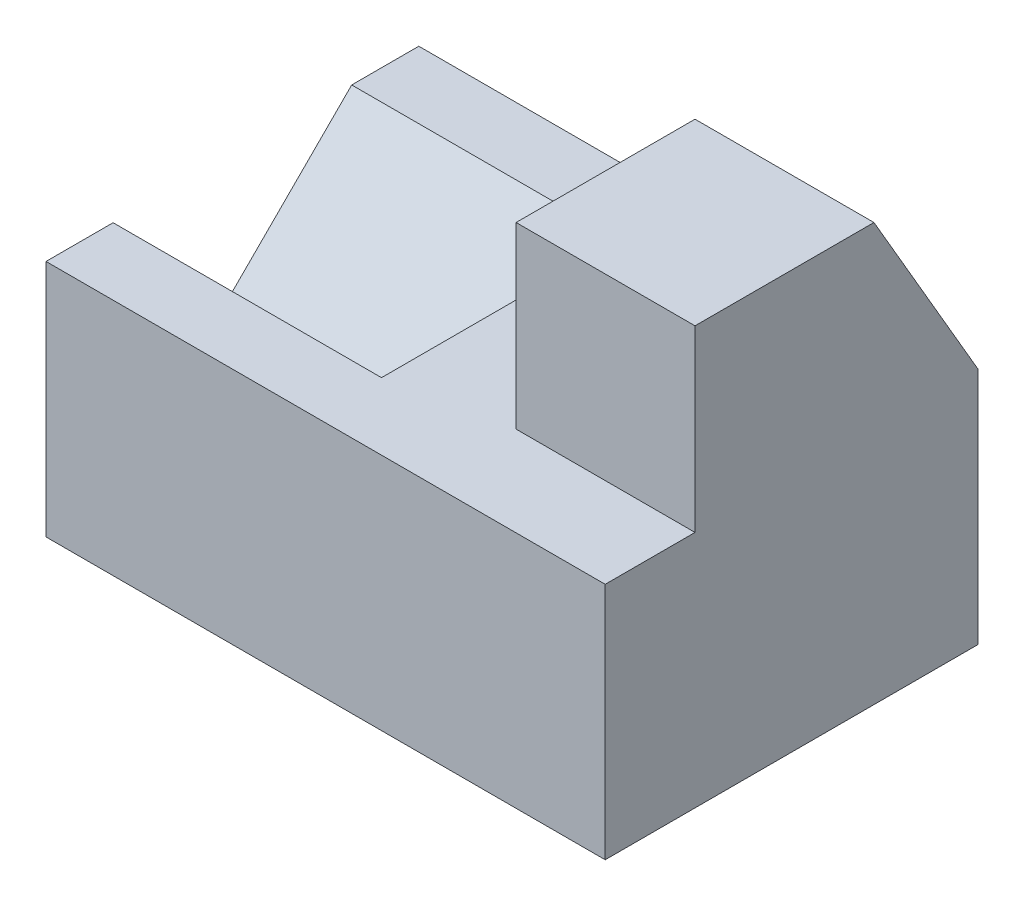
ISO-10303-21;
HEADER;
FILE_DESCRIPTION(('STEP AP214'),'2;1');
FILE_NAME('part.step','',(''),(''),'','','');
FILE_SCHEMA(('AUTOMOTIVE_DESIGN { 1 0 10303 214 1 1 1 1 }'));
ENDSEC;
DATA;
#1=APPLICATION_CONTEXT('core data for automotive mechanical design processes');
#2=APPLICATION_PROTOCOL_DEFINITION('international standard','automotive_design',2000,#1);
#3=PRODUCT_CONTEXT('',#1,'mechanical');
#4=PRODUCT('Part','Part','',(#3));
#5=PRODUCT_RELATED_PRODUCT_CATEGORY('part','',(#4));
#6=PRODUCT_DEFINITION_FORMATION('','',#4);
#7=PRODUCT_DEFINITION_CONTEXT('part definition',#1,'design');
#8=PRODUCT_DEFINITION('design','',#6,#7);
#9=PRODUCT_DEFINITION_SHAPE('','',#8);
#10=(LENGTH_UNIT() NAMED_UNIT(*) SI_UNIT(.MILLI.,.METRE.));
#11=(NAMED_UNIT(*) PLANE_ANGLE_UNIT() SI_UNIT($,.RADIAN.));
#12=(NAMED_UNIT(*) SI_UNIT($,.STERADIAN.) SOLID_ANGLE_UNIT());
#13=UNCERTAINTY_MEASURE_WITH_UNIT(LENGTH_MEASURE(1.E-05),#10,'distance_accuracy_value','');
#14=(GEOMETRIC_REPRESENTATION_CONTEXT(3) GLOBAL_UNCERTAINTY_ASSIGNED_CONTEXT((#13)) GLOBAL_UNIT_ASSIGNED_CONTEXT((#10,
#11,#12)) REPRESENTATION_CONTEXT('',''));
#15=CARTESIAN_POINT('',(0.,0.,0.));
#16=DIRECTION('',(0.,0.,1.));
#17=DIRECTION('',(1.,0.,0.));
#18=AXIS2_PLACEMENT_3D('',#15,#16,#17);
#19=CARTESIAN_POINT('',(-75.,0.,9.86934383281291));
#20=DIRECTION('',(0.,0.,-1.));
#21=DIRECTION('',(-1.,0.,0.));
#22=AXIS2_PLACEMENT_3D('',#19,#20,#21);
#23=PLANE('',#22);
#24=DIRECTION('',(0.,1.,0.));
#25=VECTOR('',#24,1.);
#26=CARTESIAN_POINT('',(-24.,13.8559556786704,9.86934383281291));
#27=LINE('',#26,#25);
#28=CARTESIAN_POINT('',(-24.,13.8559556786704,9.86934383281291));
#29=VERTEX_POINT('',#28);
#30=CARTESIAN_POINT('',(-24.,37.8559556786704,9.86934383281291));
#31=VERTEX_POINT('',#30);
#32=EDGE_CURVE('E179',#29,#31,#27,.T.);
#33=ORIENTED_EDGE('',*,*,#32,.F.);
#34=DIRECTION('',(1.,0.,0.));
#35=VECTOR('',#34,1.);
#36=CARTESIAN_POINT('',(-75.,13.8559556786704,9.86934383281291));
#37=LINE('',#36,#35);
#38=CARTESIAN_POINT('',(0.,13.8559556786704,9.86934383281291));
#39=VERTEX_POINT('',#38);
#40=EDGE_CURVE('E11',#29,#39,#37,.T.);
#41=ORIENTED_EDGE('',*,*,#40,.T.);
#42=DIRECTION('',(0.,1.,0.));
#43=VECTOR('',#42,1.);
#44=CARTESIAN_POINT('',(0.,0.,9.86934383281291));
#45=LINE('',#44,#43);
#46=CARTESIAN_POINT('',(0.,37.8559556786704,9.86934383281291));
#47=VERTEX_POINT('',#46);
#48=EDGE_CURVE('E221',#39,#47,#45,.T.);
#49=ORIENTED_EDGE('',*,*,#48,.T.);
#50=DIRECTION('',(1.,0.,0.));
#51=VECTOR('',#50,1.);
#52=CARTESIAN_POINT('',(-75.,37.8559556786704,9.86934383281291));
#53=LINE('',#52,#51);
#54=EDGE_CURVE('E55',#31,#47,#53,.T.);
#55=ORIENTED_EDGE('',*,*,#54,.F.);
#56=EDGE_LOOP('',(#33,#41,#49,#55));
#57=FACE_BOUND('',#56,.T.);
#58=ADVANCED_FACE('F45',(#57),#23,.F.);
#59=CARTESIAN_POINT('',(-75.,37.8559556786704,0.));
#60=DIRECTION('',(0.,-1.,0.));
#61=DIRECTION('',(0.,0.,-1.));
#62=AXIS2_PLACEMENT_3D('',#59,#60,#61);
#63=PLANE('',#62);
#64=DIRECTION('',(0.,0.,-1.));
#65=VECTOR('',#64,1.);
#66=CARTESIAN_POINT('',(-24.,37.8559556786704,9.86934383281291));
#67=LINE('',#66,#65);
#68=CARTESIAN_POINT('',(-24.,37.8559556786704,-14.1306561671871));
#69=VERTEX_POINT('',#68);
#70=EDGE_CURVE('E182',#31,#69,#67,.T.);
#71=ORIENTED_EDGE('',*,*,#70,.F.);
#72=ORIENTED_EDGE('',*,*,#54,.T.);
#73=DIRECTION('',(0.,0.,-1.));
#74=VECTOR('',#73,1.);
#75=CARTESIAN_POINT('',(0.,37.8559556786704,0.));
#76=LINE('',#75,#74);
#77=CARTESIAN_POINT('',(0.,37.8559556786704,-14.1306561671871));
#78=VERTEX_POINT('',#77);
#79=EDGE_CURVE('E217',#47,#78,#76,.T.);
#80=ORIENTED_EDGE('',*,*,#79,.T.);
#81=DIRECTION('',(1.,0.,0.));
#82=VECTOR('',#81,1.);
#83=CARTESIAN_POINT('',(-75.,37.8559556786704,-14.1306561671871));
#84=LINE('',#83,#82);
#85=EDGE_CURVE('E226',#69,#78,#84,.T.);
#86=ORIENTED_EDGE('',*,*,#85,.F.);
#87=EDGE_LOOP('',(#71,#72,#80,#86));
#88=FACE_BOUND('',#87,.T.);
#89=ADVANCED_FACE('F253',(#88),#63,.F.);
#90=CARTESIAN_POINT('',(-75.,15.7023340079224,-27.0098117291545));
#91=DIRECTION('',(0.,-0.502595461302605,0.864521718800645));
#92=DIRECTION('',(0.,-0.864521718800645,-0.502595461302605));
#93=AXIS2_PLACEMENT_3D('',#90,#91,#92);
#94=PLANE('',#93);
#95=DIRECTION('',(0.,-0.864521718800645,-0.502595461302605));
#96=VECTOR('',#95,1.);
#97=CARTESIAN_POINT('',(-24.,37.8559556786704,-14.1306561671871));
#98=LINE('',#97,#96);
#99=CARTESIAN_POINT('',(-24.,13.8559556786704,-28.083216072792));
#100=VERTEX_POINT('',#99);
#101=EDGE_CURVE('E170',#69,#100,#98,.T.);
#102=ORIENTED_EDGE('',*,*,#101,.F.);
#103=ORIENTED_EDGE('',*,*,#85,.T.);
#104=DIRECTION('',(0.,-0.864521718800645,-0.502595461302605));
#105=VECTOR('',#104,1.);
#106=CARTESIAN_POINT('',(0.,15.7023340079224,-27.0098117291545));
#107=LINE('',#106,#105);
#108=CARTESIAN_POINT('',(0.,13.8559556786704,-28.083216072792));
#109=VERTEX_POINT('',#108);
#110=EDGE_CURVE('E213',#78,#109,#107,.T.);
#111=ORIENTED_EDGE('',*,*,#110,.T.);
#112=DIRECTION('',(1.,0.,0.));
#113=VECTOR('',#112,1.);
#114=CARTESIAN_POINT('',(-75.,13.8559556786704,-28.083216072792));
#115=LINE('',#114,#113);
#116=EDGE_CURVE('E233',#100,#109,#115,.T.);
#117=ORIENTED_EDGE('',*,*,#116,.F.);
#118=EDGE_LOOP('',(#102,#103,#111,#117));
#119=FACE_BOUND('',#118,.T.);
#120=ADVANCED_FACE('F260',(#119),#94,.F.);
#121=CARTESIAN_POINT('',(-75.,13.8559556786704,0.));
#122=DIRECTION('',(0.,-1.,0.));
#123=DIRECTION('',(0.,0.,-1.));
#124=AXIS2_PLACEMENT_3D('',#121,#122,#123);
#125=PLANE('',#124);
#126=DIRECTION('',(0.,0.,-1.));
#127=VECTOR('',#126,1.);
#128=CARTESIAN_POINT('',(-75.,13.8559556786704,0.));
#129=LINE('',#128,#127);
#130=CARTESIAN_POINT('',(-75.,13.8559556786704,-19.083216072792));
#131=VERTEX_POINT('',#130);
#132=CARTESIAN_POINT('',(-75.,13.8559556786704,-28.083216072792));
#133=VERTEX_POINT('',#132);
#134=EDGE_CURVE('E71',#131,#133,#129,.T.);
#135=ORIENTED_EDGE('',*,*,#134,.F.);
#136=DIRECTION('',(-1.,0.,0.));
#137=VECTOR('',#136,1.);
#138=CARTESIAN_POINT('',(-39.,13.8559556786704,-19.083216072792));
#139=LINE('',#138,#137);
#140=CARTESIAN_POINT('',(-39.,13.8559556786704,-19.083216072792));
#141=VERTEX_POINT('',#140);
#142=EDGE_CURVE('E167',#141,#131,#139,.T.);
#143=ORIENTED_EDGE('',*,*,#142,.F.);
#144=DIRECTION('',(0.,0.,-1.));
#145=VECTOR('',#144,1.);
#146=CARTESIAN_POINT('',(-39.,13.8559556786704,-19.083216072792));
#147=LINE('',#146,#145);
#148=CARTESIAN_POINT('',(-39.,13.8559556786704,12.916783927208));
#149=VERTEX_POINT('',#148);
#150=EDGE_CURVE('E145',#149,#141,#147,.T.);
#151=ORIENTED_EDGE('',*,*,#150,.F.);
#152=DIRECTION('',(-1.,0.,0.));
#153=VECTOR('',#152,1.);
#154=CARTESIAN_POINT('',(-39.,13.8559556786704,12.916783927208));
#155=LINE('',#154,#153);
#156=CARTESIAN_POINT('',(-75.,13.8559556786704,12.916783927208));
#157=VERTEX_POINT('',#156);
#158=EDGE_CURVE('E144',#149,#157,#155,.T.);
#159=ORIENTED_EDGE('',*,*,#158,.T.);
#160=CARTESIAN_POINT('',(-75.,13.8559556786704,21.916783927208));
#161=VERTEX_POINT('',#160);
#162=EDGE_CURVE('E186',#161,#157,#129,.T.);
#163=ORIENTED_EDGE('',*,*,#162,.F.);
#164=DIRECTION('',(1.,0.,0.));
#165=VECTOR('',#164,1.);
#166=CARTESIAN_POINT('',(-75.,13.8559556786704,21.916783927208));
#167=LINE('',#166,#165);
#168=CARTESIAN_POINT('',(0.,13.8559556786704,21.916783927208));
#169=VERTEX_POINT('',#168);
#170=EDGE_CURVE('E49',#161,#169,#167,.T.);
#171=ORIENTED_EDGE('',*,*,#170,.T.);
#172=DIRECTION('',(0.,0.,-1.));
#173=VECTOR('',#172,1.);
#174=CARTESIAN_POINT('',(0.,13.8559556786704,0.));
#175=LINE('',#174,#173);
#176=EDGE_CURVE('E185',#169,#39,#175,.T.);
#177=ORIENTED_EDGE('',*,*,#176,.T.);
#178=ORIENTED_EDGE('',*,*,#40,.F.);
#179=DIRECTION('',(0.,0.,1.));
#180=VECTOR('',#179,1.);
#181=CARTESIAN_POINT('',(-24.,13.8559556786704,-28.083216072792));
#182=LINE('',#181,#180);
#183=EDGE_CURVE('E176',#100,#29,#182,.T.);
#184=ORIENTED_EDGE('',*,*,#183,.F.);
#185=EDGE_CURVE('E229',#133,#100,#115,.T.);
#186=ORIENTED_EDGE('',*,*,#185,.F.);
#187=EDGE_LOOP('',(#135,#143,#151,#159,#163,#171,#177,#178,#184,#186));
#188=FACE_BOUND('',#187,.T.);
#189=ADVANCED_FACE('F47',(#188),#125,.F.);
#190=CARTESIAN_POINT('',(-75.,0.,-28.083216072792));
#191=DIRECTION('',(0.,0.,-1.));
#192=DIRECTION('',(-1.,0.,0.));
#193=AXIS2_PLACEMENT_3D('',#190,#191,#192);
#194=PLANE('',#193);
#195=DIRECTION('',(0.,1.,0.));
#196=VECTOR('',#195,1.);
#197=CARTESIAN_POINT('',(0.,0.,-28.083216072792));
#198=LINE('',#197,#196);
#199=CARTESIAN_POINT('',(0.,-18.1440443213296,-28.083216072792));
#200=VERTEX_POINT('',#199);
#201=EDGE_CURVE('E209',#200,#109,#198,.T.);
#202=ORIENTED_EDGE('',*,*,#201,.F.);
#203=DIRECTION('',(1.,0.,0.));
#204=VECTOR('',#203,1.);
#205=CARTESIAN_POINT('',(-75.,-18.1440443213296,-28.083216072792));
#206=LINE('',#205,#204);
#207=CARTESIAN_POINT('',(-75.,-18.1440443213296,-28.083216072792));
#208=VERTEX_POINT('',#207);
#209=EDGE_CURVE('E234',#208,#200,#206,.T.);
#210=ORIENTED_EDGE('',*,*,#209,.F.);
#211=DIRECTION('',(0.,1.,0.));
#212=VECTOR('',#211,1.);
#213=CARTESIAN_POINT('',(-75.,0.,-28.083216072792));
#214=LINE('',#213,#212);
#215=EDGE_CURVE('E195',#208,#133,#214,.T.);
#216=ORIENTED_EDGE('',*,*,#215,.T.);
#217=ORIENTED_EDGE('',*,*,#185,.T.);
#218=ORIENTED_EDGE('',*,*,#116,.T.);
#219=EDGE_LOOP('',(#202,#210,#216,#217,#218));
#220=FACE_BOUND('',#219,.T.);
#221=ADVANCED_FACE('F264',(#220),#194,.T.);
#222=CARTESIAN_POINT('',(-75.,-18.1440443213296,0.));
#223=DIRECTION('',(0.,-1.,0.));
#224=DIRECTION('',(0.,0.,-1.));
#225=AXIS2_PLACEMENT_3D('',#222,#223,#224);
#226=PLANE('',#225);
#227=DIRECTION('',(0.,0.,-1.));
#228=VECTOR('',#227,1.);
#229=CARTESIAN_POINT('',(0.,-18.1440443213296,0.));
#230=LINE('',#229,#228);
#231=CARTESIAN_POINT('',(0.,-18.1440443213296,21.916783927208));
#232=VERTEX_POINT('',#231);
#233=EDGE_CURVE('E205',#232,#200,#230,.T.);
#234=ORIENTED_EDGE('',*,*,#233,.F.);
#235=DIRECTION('',(1.,0.,0.));
#236=VECTOR('',#235,1.);
#237=CARTESIAN_POINT('',(-75.,-18.1440443213296,21.916783927208));
#238=LINE('',#237,#236);
#239=CARTESIAN_POINT('',(-75.,-18.1440443213296,21.916783927208));
#240=VERTEX_POINT('',#239);
#241=EDGE_CURVE('E236',#240,#232,#238,.T.);
#242=ORIENTED_EDGE('',*,*,#241,.F.);
#243=DIRECTION('',(0.,0.,-1.));
#244=VECTOR('',#243,1.);
#245=CARTESIAN_POINT('',(-75.,-18.1440443213296,0.));
#246=LINE('',#245,#244);
#247=EDGE_CURVE('E191',#240,#208,#246,.T.);
#248=ORIENTED_EDGE('',*,*,#247,.T.);
#249=ORIENTED_EDGE('',*,*,#209,.T.);
#250=EDGE_LOOP('',(#234,#242,#248,#249));
#251=FACE_BOUND('',#250,.T.);
#252=ADVANCED_FACE('F275',(#251),#226,.T.);
#253=CARTESIAN_POINT('',(-75.,0.,21.916783927208));
#254=DIRECTION('',(0.,0.,-1.));
#255=DIRECTION('',(0.,1.,0.));
#256=AXIS2_PLACEMENT_3D('',#253,#254,#255);
#257=PLANE('',#256);
#258=DIRECTION('',(0.,1.,0.));
#259=VECTOR('',#258,1.);
#260=CARTESIAN_POINT('',(0.,0.,21.916783927208));
#261=LINE('',#260,#259);
#262=EDGE_CURVE('E202',#232,#169,#261,.T.);
#263=ORIENTED_EDGE('',*,*,#262,.T.);
#264=ORIENTED_EDGE('',*,*,#170,.F.);
#265=DIRECTION('',(0.,1.,0.));
#266=VECTOR('',#265,1.);
#267=CARTESIAN_POINT('',(-75.,0.,21.916783927208));
#268=LINE('',#267,#266);
#269=EDGE_CURVE('E108',#240,#161,#268,.T.);
#270=ORIENTED_EDGE('',*,*,#269,.F.);
#271=ORIENTED_EDGE('',*,*,#241,.T.);
#272=EDGE_LOOP('',(#263,#264,#270,#271));
#273=FACE_BOUND('',#272,.T.);
#274=ADVANCED_FACE('F268',(#273),#257,.F.);
#275=CARTESIAN_POINT('',(-75.,0.,0.));
#276=DIRECTION('',(1.,0.,0.));
#277=DIRECTION('',(0.,0.,-1.));
#278=AXIS2_PLACEMENT_3D('',#275,#276,#277);
#279=PLANE('',#278);
#280=DIRECTION('',(0.,0.707106781186547,0.707106781186548));
#281=VECTOR('',#280,1.);
#282=CARTESIAN_POINT('',(-75.,13.8559556786704,12.916783927208));
#283=LINE('',#282,#281);
#284=CARTESIAN_POINT('',(-75.,-2.14404432132965,-3.08321607279199));
#285=VERTEX_POINT('',#284);
#286=EDGE_CURVE('E158',#285,#157,#283,.T.);
#287=ORIENTED_EDGE('',*,*,#286,.F.);
#288=DIRECTION('',(0.,-0.707106781186548,0.707106781186547));
#289=VECTOR('',#288,1.);
#290=CARTESIAN_POINT('',(-75.,13.8559556786704,-19.083216072792));
#291=LINE('',#290,#289);
#292=EDGE_CURVE('E63',#131,#285,#291,.T.);
#293=ORIENTED_EDGE('',*,*,#292,.F.);
#294=ORIENTED_EDGE('',*,*,#134,.T.);
#295=ORIENTED_EDGE('',*,*,#215,.F.);
#296=ORIENTED_EDGE('',*,*,#247,.F.);
#297=ORIENTED_EDGE('',*,*,#269,.T.);
#298=ORIENTED_EDGE('',*,*,#162,.T.);
#299=EDGE_LOOP('',(#287,#293,#294,#295,#296,#297,#298));
#300=FACE_BOUND('',#299,.T.);
#301=ADVANCED_FACE('F266',(#300),#279,.F.);
#302=CARTESIAN_POINT('',(0.,0.,0.));
#303=DIRECTION('',(1.,0.,0.));
#304=DIRECTION('',(0.,0.,-1.));
#305=AXIS2_PLACEMENT_3D('',#302,#303,#304);
#306=PLANE('',#305);
#307=ORIENTED_EDGE('',*,*,#176,.F.);
#308=ORIENTED_EDGE('',*,*,#262,.F.);
#309=ORIENTED_EDGE('',*,*,#233,.T.);
#310=ORIENTED_EDGE('',*,*,#201,.T.);
#311=ORIENTED_EDGE('',*,*,#110,.F.);
#312=ORIENTED_EDGE('',*,*,#79,.F.);
#313=ORIENTED_EDGE('',*,*,#48,.F.);
#314=EDGE_LOOP('',(#307,#308,#309,#310,#311,#312,#313));
#315=FACE_BOUND('',#314,.T.);
#316=ADVANCED_FACE('F246',(#315),#306,.T.);
#317=CARTESIAN_POINT('',(-24.,0.,0.));
#318=DIRECTION('',(-1.,0.,0.));
#319=DIRECTION('',(0.,0.,1.));
#320=AXIS2_PLACEMENT_3D('',#317,#318,#319);
#321=PLANE('',#320);
#322=ORIENTED_EDGE('',*,*,#101,.T.);
#323=ORIENTED_EDGE('',*,*,#183,.T.);
#324=ORIENTED_EDGE('',*,*,#32,.T.);
#325=ORIENTED_EDGE('',*,*,#70,.T.);
#326=EDGE_LOOP('',(#322,#323,#324,#325));
#327=FACE_BOUND('',#326,.T.);
#328=ADVANCED_FACE('F257',(#327),#321,.T.);
#329=CARTESIAN_POINT('',(-39.,13.8559556786704,-19.083216072792));
#330=DIRECTION('',(0.,-0.707106781186547,-0.707106781186548));
#331=DIRECTION('',(0.,0.707106781186548,-0.707106781186547));
#332=AXIS2_PLACEMENT_3D('',#329,#330,#331);
#333=PLANE('',#332);
#334=ORIENTED_EDGE('',*,*,#292,.T.);
#335=DIRECTION('',(-1.,0.,0.));
#336=VECTOR('',#335,1.);
#337=CARTESIAN_POINT('',(-39.,-2.14404432132965,-3.08321607279199));
#338=LINE('',#337,#336);
#339=CARTESIAN_POINT('',(-39.,-2.14404432132965,-3.08321607279199));
#340=VERTEX_POINT('',#339);
#341=EDGE_CURVE('E135',#340,#285,#338,.T.);
#342=ORIENTED_EDGE('',*,*,#341,.F.);
#343=DIRECTION('',(0.,-0.707106781186548,0.707106781186547));
#344=VECTOR('',#343,1.);
#345=CARTESIAN_POINT('',(-39.,13.8559556786704,-19.083216072792));
#346=LINE('',#345,#344);
#347=EDGE_CURVE('E139',#141,#340,#346,.T.);
#348=ORIENTED_EDGE('',*,*,#347,.F.);
#349=ORIENTED_EDGE('',*,*,#142,.T.);
#350=EDGE_LOOP('',(#334,#342,#348,#349));
#351=FACE_BOUND('',#350,.T.);
#352=ADVANCED_FACE('F137',(#351),#333,.F.);
#353=CARTESIAN_POINT('',(-39.,13.8559556786704,12.916783927208));
#354=DIRECTION('',(0.,-0.707106781186548,0.707106781186547));
#355=DIRECTION('',(0.,-0.707106781186547,-0.707106781186548));
#356=AXIS2_PLACEMENT_3D('',#353,#354,#355);
#357=PLANE('',#356);
#358=ORIENTED_EDGE('',*,*,#286,.T.);
#359=ORIENTED_EDGE('',*,*,#158,.F.);
#360=DIRECTION('',(0.,0.707106781186547,0.707106781186548));
#361=VECTOR('',#360,1.);
#362=CARTESIAN_POINT('',(-39.,13.8559556786704,12.916783927208));
#363=LINE('',#362,#361);
#364=EDGE_CURVE('E148',#340,#149,#363,.T.);
#365=ORIENTED_EDGE('',*,*,#364,.F.);
#366=ORIENTED_EDGE('',*,*,#341,.T.);
#367=EDGE_LOOP('',(#358,#359,#365,#366));
#368=FACE_BOUND('',#367,.T.);
#369=ADVANCED_FACE('F149',(#368),#357,.F.);
#370=CARTESIAN_POINT('',(-39.,0.,0.));
#371=DIRECTION('',(1.,0.,0.));
#372=DIRECTION('',(0.,0.,-1.));
#373=AXIS2_PLACEMENT_3D('',#370,#371,#372);
#374=PLANE('',#373);
#375=ORIENTED_EDGE('',*,*,#347,.T.);
#376=ORIENTED_EDGE('',*,*,#364,.T.);
#377=ORIENTED_EDGE('',*,*,#150,.T.);
#378=EDGE_LOOP('',(#375,#376,#377));
#379=FACE_BOUND('',#378,.T.);
#380=ADVANCED_FACE('F155',(#379),#374,.F.);
#381=CLOSED_SHELL('',(#58,#89,#120,#189,#221,#252,#274,#301,#316,#328,#352,#369,#380));
#382=MANIFOLD_SOLID_BREP('B2',#381);
#383=ADVANCED_BREP_SHAPE_REPRESENTATION('',(#18,#382),#14);
#384=SHAPE_DEFINITION_REPRESENTATION(#9,#383);
ENDSEC;
END-ISO-10303-21;
